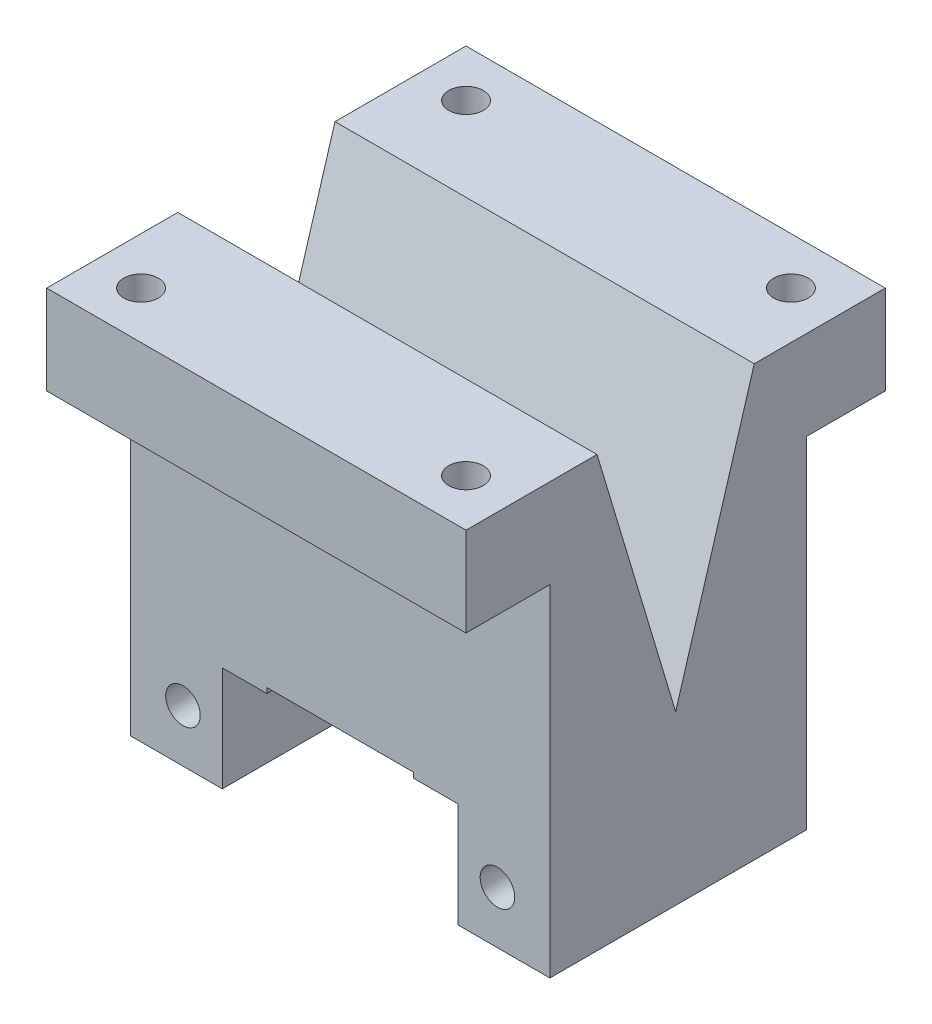
ISO-10303-21;
HEADER;
FILE_DESCRIPTION(('STEP AP214'),'2;1');
FILE_NAME('part.step','',(''),(''),'','','');
FILE_SCHEMA(('AUTOMOTIVE_DESIGN { 1 0 10303 214 1 1 1 1 }'));
ENDSEC;
DATA;
#1=APPLICATION_CONTEXT('core data for automotive mechanical design processes');
#2=APPLICATION_PROTOCOL_DEFINITION('international standard','automotive_design',2000,#1);
#3=PRODUCT_CONTEXT('',#1,'mechanical');
#4=PRODUCT('Part','Part','',(#3));
#5=PRODUCT_RELATED_PRODUCT_CATEGORY('part','',(#4));
#6=PRODUCT_DEFINITION_FORMATION('','',#4);
#7=PRODUCT_DEFINITION_CONTEXT('part definition',#1,'design');
#8=PRODUCT_DEFINITION('design','',#6,#7);
#9=PRODUCT_DEFINITION_SHAPE('','',#8);
#10=(LENGTH_UNIT() NAMED_UNIT(*) SI_UNIT(.MILLI.,.METRE.));
#11=(NAMED_UNIT(*) PLANE_ANGLE_UNIT() SI_UNIT($,.RADIAN.));
#12=(NAMED_UNIT(*) SI_UNIT($,.STERADIAN.) SOLID_ANGLE_UNIT());
#13=UNCERTAINTY_MEASURE_WITH_UNIT(LENGTH_MEASURE(1.E-05),#10,'distance_accuracy_value','');
#14=(GEOMETRIC_REPRESENTATION_CONTEXT(3) GLOBAL_UNCERTAINTY_ASSIGNED_CONTEXT((#13)) GLOBAL_UNIT_ASSIGNED_CONTEXT((#10,
#11,#12)) REPRESENTATION_CONTEXT('',''));
#15=CARTESIAN_POINT('',(0.,0.,0.));
#16=DIRECTION('',(0.,0.,1.));
#17=DIRECTION('',(1.,0.,0.));
#18=AXIS2_PLACEMENT_3D('',#15,#16,#17);
#19=CARTESIAN_POINT('',(0.,0.,0.));
#20=DIRECTION('',(0.,-1.,0.));
#21=DIRECTION('',(0.,0.,-1.));
#22=AXIS2_PLACEMENT_3D('',#19,#20,#21);
#23=PLANE('',#22);
#24=CARTESIAN_POINT('',(15.5,0.,-15.5));
#25=DIRECTION('',(0.,1.,0.));
#26=DIRECTION('',(0.,0.,1.));
#27=AXIS2_PLACEMENT_3D('',#24,#25,#26);
#28=CIRCLE('',#27,1.64999999999999);
#29=CARTESIAN_POINT('',(15.5,0.,-13.85));
#30=VERTEX_POINT('',#29);
#31=EDGE_CURVE('E376',#30,#30,#28,.T.);
#32=ORIENTED_EDGE('',*,*,#31,.F.);
#33=EDGE_LOOP('',(#32));
#34=FACE_BOUND('',#33,.T.);
#35=CARTESIAN_POINT('',(-15.5,0.,-15.5));
#36=DIRECTION('',(0.,1.,0.));
#37=DIRECTION('',(0.,0.,1.));
#38=AXIS2_PLACEMENT_3D('',#35,#36,#37);
#39=CIRCLE('',#38,1.64999999999999);
#40=CARTESIAN_POINT('',(-15.5,0.,-13.85));
#41=VERTEX_POINT('',#40);
#42=EDGE_CURVE('E373',#41,#41,#39,.T.);
#43=ORIENTED_EDGE('',*,*,#42,.F.);
#44=EDGE_LOOP('',(#43));
#45=FACE_BOUND('',#44,.T.);
#46=DIRECTION('',(0.,0.,1.));
#47=VECTOR('',#46,1.);
#48=CARTESIAN_POINT('',(-20.,0.,-20.));
#49=LINE('',#48,#47);
#50=CARTESIAN_POINT('',(-20.,0.,-20.));
#51=VERTEX_POINT('',#50);
#52=CARTESIAN_POINT('',(-20.,0.,-7.5));
#53=VERTEX_POINT('',#52);
#54=EDGE_CURVE('E393',#51,#53,#49,.T.);
#55=ORIENTED_EDGE('',*,*,#54,.T.);
#56=DIRECTION('',(-1.,0.,0.));
#57=VECTOR('',#56,1.);
#58=CARTESIAN_POINT('',(20.,0.,-7.5));
#59=LINE('',#58,#57);
#60=CARTESIAN_POINT('',(20.,0.,-7.5));
#61=VERTEX_POINT('',#60);
#62=EDGE_CURVE('E280',#61,#53,#59,.T.);
#63=ORIENTED_EDGE('',*,*,#62,.F.);
#64=DIRECTION('',(0.,0.,-1.));
#65=VECTOR('',#64,1.);
#66=CARTESIAN_POINT('',(20.,0.,-20.));
#67=LINE('',#66,#65);
#68=CARTESIAN_POINT('',(20.,0.,-20.));
#69=VERTEX_POINT('',#68);
#70=EDGE_CURVE('E399',#61,#69,#67,.T.);
#71=ORIENTED_EDGE('',*,*,#70,.T.);
#72=DIRECTION('',(-1.,0.,0.));
#73=VECTOR('',#72,1.);
#74=CARTESIAN_POINT('',(20.,0.,-20.));
#75=LINE('',#74,#73);
#76=EDGE_CURVE('E390',#69,#51,#75,.T.);
#77=ORIENTED_EDGE('',*,*,#76,.T.);
#78=EDGE_LOOP('',(#55,#63,#71,#77));
#79=FACE_BOUND('',#78,.T.);
#80=ADVANCED_FACE('F35',(#34,#45,#79),#23,.F.);
#81=CARTESIAN_POINT('',(20.,-41.,-20.));
#82=DIRECTION('',(0.,0.,-1.));
#83=DIRECTION('',(-1.,0.,0.));
#84=AXIS2_PLACEMENT_3D('',#81,#82,#83);
#85=PLANE('',#84);
#86=DIRECTION('',(0.,1.,0.));
#87=VECTOR('',#86,1.);
#88=CARTESIAN_POINT('',(20.,-41.,-20.));
#89=LINE('',#88,#87);
#90=CARTESIAN_POINT('',(20.,-8.5,-20.));
#91=VERTEX_POINT('',#90);
#92=EDGE_CURVE('E407',#91,#69,#89,.T.);
#93=ORIENTED_EDGE('',*,*,#92,.F.);
#94=DIRECTION('',(1.,0.,0.));
#95=VECTOR('',#94,1.);
#96=CARTESIAN_POINT('',(-20.,-8.5,-20.));
#97=LINE('',#96,#95);
#98=CARTESIAN_POINT('',(-20.,-8.5,-20.));
#99=VERTEX_POINT('',#98);
#100=EDGE_CURVE('E332',#99,#91,#97,.T.);
#101=ORIENTED_EDGE('',*,*,#100,.F.);
#102=DIRECTION('',(0.,1.,0.));
#103=VECTOR('',#102,1.);
#104=CARTESIAN_POINT('',(-20.,-41.,-20.));
#105=LINE('',#104,#103);
#106=EDGE_CURVE('E405',#99,#51,#105,.T.);
#107=ORIENTED_EDGE('',*,*,#106,.T.);
#108=ORIENTED_EDGE('',*,*,#76,.F.);
#109=EDGE_LOOP('',(#93,#101,#107,#108));
#110=FACE_BOUND('',#109,.T.);
#111=ADVANCED_FACE('F492',(#110),#85,.T.);
#112=CARTESIAN_POINT('',(20.,-41.,20.));
#113=DIRECTION('',(0.,0.,1.));
#114=DIRECTION('',(1.,0.,0.));
#115=AXIS2_PLACEMENT_3D('',#112,#113,#114);
#116=PLANE('',#115);
#117=DIRECTION('',(0.,1.,0.));
#118=VECTOR('',#117,1.);
#119=CARTESIAN_POINT('',(-20.,-41.,20.));
#120=LINE('',#119,#118);
#121=CARTESIAN_POINT('',(-20.,-8.5,20.));
#122=VERTEX_POINT('',#121);
#123=CARTESIAN_POINT('',(-20.,0.,20.));
#124=VERTEX_POINT('',#123);
#125=EDGE_CURVE('E392',#122,#124,#120,.T.);
#126=ORIENTED_EDGE('',*,*,#125,.F.);
#127=DIRECTION('',(-1.,0.,0.));
#128=VECTOR('',#127,1.);
#129=CARTESIAN_POINT('',(-20.,-8.5,20.));
#130=LINE('',#129,#128);
#131=CARTESIAN_POINT('',(20.,-8.5,20.));
#132=VERTEX_POINT('',#131);
#133=EDGE_CURVE('E207',#132,#122,#130,.T.);
#134=ORIENTED_EDGE('',*,*,#133,.F.);
#135=DIRECTION('',(0.,1.,0.));
#136=VECTOR('',#135,1.);
#137=CARTESIAN_POINT('',(20.,-41.,20.));
#138=LINE('',#137,#136);
#139=CARTESIAN_POINT('',(20.,0.,20.));
#140=VERTEX_POINT('',#139);
#141=EDGE_CURVE('E204',#132,#140,#138,.T.);
#142=ORIENTED_EDGE('',*,*,#141,.T.);
#143=DIRECTION('',(1.,0.,0.));
#144=VECTOR('',#143,1.);
#145=CARTESIAN_POINT('',(20.,0.,20.));
#146=LINE('',#145,#144);
#147=EDGE_CURVE('E396',#124,#140,#146,.T.);
#148=ORIENTED_EDGE('',*,*,#147,.F.);
#149=EDGE_LOOP('',(#126,#134,#142,#148));
#150=FACE_BOUND('',#149,.T.);
#151=ADVANCED_FACE('F499',(#150),#116,.T.);
#152=CARTESIAN_POINT('',(-15.5,0.,15.5));
#153=DIRECTION('',(0.,1.,0.));
#154=DIRECTION('',(0.,0.,1.));
#155=AXIS2_PLACEMENT_3D('',#152,#153,#154);
#156=CYLINDRICAL_SURFACE('',#155,1.64999999999999);
#157=CARTESIAN_POINT('',(-15.5,0.,15.5));
#158=DIRECTION('',(0.,1.,0.));
#159=DIRECTION('',(0.,0.,1.));
#160=AXIS2_PLACEMENT_3D('',#157,#158,#159);
#161=CIRCLE('',#160,1.64999999999999);
#162=CARTESIAN_POINT('',(-15.5,0.,17.15));
#163=VERTEX_POINT('',#162);
#164=EDGE_CURVE('E382',#163,#163,#161,.T.);
#165=ORIENTED_EDGE('',*,*,#164,.T.);
#166=EDGE_LOOP('',(#165));
#167=FACE_BOUND('',#166,.T.);
#168=CARTESIAN_POINT('',(-15.5,-8.5,15.5));
#169=DIRECTION('',(0.,-1.,0.));
#170=DIRECTION('',(0.,0.,-1.));
#171=AXIS2_PLACEMENT_3D('',#168,#169,#170);
#172=CIRCLE('',#171,1.64999999999999);
#173=CARTESIAN_POINT('',(-15.5,-8.5,13.85));
#174=VERTEX_POINT('',#173);
#175=EDGE_CURVE('E358',#174,#174,#172,.F.);
#176=ORIENTED_EDGE('',*,*,#175,.F.);
#177=EDGE_LOOP('',(#176));
#178=FACE_BOUND('',#177,.T.);
#179=ADVANCED_FACE('F529',(#167,#178),#156,.F.);
#180=CARTESIAN_POINT('',(15.5,0.,15.5));
#181=DIRECTION('',(0.,1.,0.));
#182=DIRECTION('',(0.,0.,1.));
#183=AXIS2_PLACEMENT_3D('',#180,#181,#182);
#184=CYLINDRICAL_SURFACE('',#183,1.64999999999999);
#185=CARTESIAN_POINT('',(15.5,0.,15.5));
#186=DIRECTION('',(0.,1.,0.));
#187=DIRECTION('',(0.,0.,1.));
#188=AXIS2_PLACEMENT_3D('',#185,#186,#187);
#189=CIRCLE('',#188,1.64999999999999);
#190=CARTESIAN_POINT('',(15.5,0.,17.15));
#191=VERTEX_POINT('',#190);
#192=EDGE_CURVE('E379',#191,#191,#189,.T.);
#193=ORIENTED_EDGE('',*,*,#192,.T.);
#194=EDGE_LOOP('',(#193));
#195=FACE_BOUND('',#194,.T.);
#196=CARTESIAN_POINT('',(15.5,-8.5,15.5));
#197=DIRECTION('',(0.,-1.,0.));
#198=DIRECTION('',(0.,0.,-1.));
#199=AXIS2_PLACEMENT_3D('',#196,#197,#198);
#200=CIRCLE('',#199,1.64999999999999);
#201=CARTESIAN_POINT('',(15.5,-8.5,13.85));
#202=VERTEX_POINT('',#201);
#203=EDGE_CURVE('E357',#202,#202,#200,.F.);
#204=ORIENTED_EDGE('',*,*,#203,.F.);
#205=EDGE_LOOP('',(#204));
#206=FACE_BOUND('',#205,.T.);
#207=ADVANCED_FACE('F533',(#195,#206),#184,.F.);
#208=CARTESIAN_POINT('',(15.5,0.,-15.5));
#209=DIRECTION('',(0.,1.,0.));
#210=DIRECTION('',(0.,0.,1.));
#211=AXIS2_PLACEMENT_3D('',#208,#209,#210);
#212=CYLINDRICAL_SURFACE('',#211,1.64999999999999);
#213=ORIENTED_EDGE('',*,*,#31,.T.);
#214=EDGE_LOOP('',(#213));
#215=FACE_BOUND('',#214,.T.);
#216=CARTESIAN_POINT('',(15.5,-8.5,-15.5));
#217=DIRECTION('',(0.,-1.,0.));
#218=DIRECTION('',(0.,0.,-1.));
#219=AXIS2_PLACEMENT_3D('',#216,#217,#218);
#220=CIRCLE('',#219,1.64999999999999);
#221=CARTESIAN_POINT('',(15.5,-8.5,-17.15));
#222=VERTEX_POINT('',#221);
#223=EDGE_CURVE('E354',#222,#222,#220,.F.);
#224=ORIENTED_EDGE('',*,*,#223,.F.);
#225=EDGE_LOOP('',(#224));
#226=FACE_BOUND('',#225,.T.);
#227=ADVANCED_FACE('F549',(#215,#226),#212,.F.);
#228=CARTESIAN_POINT('',(-15.5,0.,-15.5));
#229=DIRECTION('',(0.,1.,0.));
#230=DIRECTION('',(0.,0.,1.));
#231=AXIS2_PLACEMENT_3D('',#228,#229,#230);
#232=CYLINDRICAL_SURFACE('',#231,1.64999999999999);
#233=ORIENTED_EDGE('',*,*,#42,.T.);
#234=EDGE_LOOP('',(#233));
#235=FACE_BOUND('',#234,.T.);
#236=CARTESIAN_POINT('',(-15.5,-8.5,-15.5));
#237=DIRECTION('',(0.,-1.,0.));
#238=DIRECTION('',(0.,0.,-1.));
#239=AXIS2_PLACEMENT_3D('',#236,#237,#238);
#240=CIRCLE('',#239,1.64999999999999);
#241=CARTESIAN_POINT('',(-15.5,-8.5,-17.15));
#242=VERTEX_POINT('',#241);
#243=EDGE_CURVE('E353',#242,#242,#240,.F.);
#244=ORIENTED_EDGE('',*,*,#243,.F.);
#245=EDGE_LOOP('',(#244));
#246=FACE_BOUND('',#245,.T.);
#247=ADVANCED_FACE('F553',(#235,#246),#232,.F.);
#248=CARTESIAN_POINT('',(0.,-39.5,0.));
#249=DIRECTION('',(0.,1.,0.));
#250=DIRECTION('',(-1.,0.,0.));
#251=AXIS2_PLACEMENT_3D('',#248,#249,#250);
#252=PLANE('',#251);
#253=DIRECTION('',(1.,0.,0.));
#254=VECTOR('',#253,1.);
#255=CARTESIAN_POINT('',(-11.25,-39.5,0.));
#256=LINE('',#255,#254);
#257=CARTESIAN_POINT('',(-11.25,-39.5,0.));
#258=VERTEX_POINT('',#257);
#259=CARTESIAN_POINT('',(-10.,-39.5,0.));
#260=VERTEX_POINT('',#259);
#261=EDGE_CURVE('E305',#258,#260,#256,.T.);
#262=ORIENTED_EDGE('',*,*,#261,.T.);
#263=CARTESIAN_POINT('',(0.,-39.5,0.));
#264=DIRECTION('',(0.,1.,0.));
#265=DIRECTION('',(-1.,0.,0.));
#266=AXIS2_PLACEMENT_3D('',#263,#264,#265);
#267=CIRCLE('',#266,10.);
#268=CARTESIAN_POINT('',(10.,-39.5,0.));
#269=VERTEX_POINT('',#268);
#270=EDGE_CURVE('E361',#260,#269,#267,.F.);
#271=ORIENTED_EDGE('',*,*,#270,.T.);
#272=CARTESIAN_POINT('',(11.25,-39.5,0.));
#273=VERTEX_POINT('',#272);
#274=EDGE_CURVE('E308',#269,#273,#256,.T.);
#275=ORIENTED_EDGE('',*,*,#274,.T.);
#276=CARTESIAN_POINT('',(0.,-39.5,0.));
#277=DIRECTION('',(0.,1.,0.));
#278=DIRECTION('',(-1.,0.,0.));
#279=AXIS2_PLACEMENT_3D('',#276,#277,#278);
#280=CIRCLE('',#279,11.25);
#281=EDGE_CURVE('E370',#273,#258,#280,.T.);
#282=ORIENTED_EDGE('',*,*,#281,.T.);
#283=EDGE_LOOP('',(#262,#271,#275,#282));
#284=FACE_BOUND('',#283,.T.);
#285=ADVANCED_FACE('F450',(#284),#252,.T.);
#286=CARTESIAN_POINT('',(0.,0.,0.));
#287=DIRECTION('',(0.,1.,0.));
#288=DIRECTION('',(-1.,0.,0.));
#289=AXIS2_PLACEMENT_3D('',#286,#287,#288);
#290=CYLINDRICAL_SURFACE('',#289,11.25);
#291=DIRECTION('',(0.,-1.,0.));
#292=VECTOR('',#291,1.);
#293=CARTESIAN_POINT('',(-11.25,-39.5,0.));
#294=LINE('',#293,#292);
#295=CARTESIAN_POINT('',(-11.25,-32.5,0.));
#296=VERTEX_POINT('',#295);
#297=EDGE_CURVE('E321',#296,#258,#294,.T.);
#298=ORIENTED_EDGE('',*,*,#297,.T.);
#299=ORIENTED_EDGE('',*,*,#281,.F.);
#300=DIRECTION('',(0.,1.,0.));
#301=VECTOR('',#300,1.);
#302=CARTESIAN_POINT('',(11.25,-32.5,0.));
#303=LINE('',#302,#301);
#304=CARTESIAN_POINT('',(11.25,-32.5,0.));
#305=VERTEX_POINT('',#304);
#306=EDGE_CURVE('E208',#273,#305,#303,.T.);
#307=ORIENTED_EDGE('',*,*,#306,.T.);
#308=CARTESIAN_POINT('',(0.,-32.5,0.));
#309=DIRECTION('',(0.,1.,0.));
#310=DIRECTION('',(-1.,0.,0.));
#311=AXIS2_PLACEMENT_3D('',#308,#309,#310);
#312=CIRCLE('',#311,11.25);
#313=EDGE_CURVE('E367',#305,#296,#312,.T.);
#314=ORIENTED_EDGE('',*,*,#313,.T.);
#315=EDGE_LOOP('',(#298,#299,#307,#314));
#316=FACE_BOUND('',#315,.T.);
#317=ADVANCED_FACE('F447',(#316),#290,.F.);
#318=CARTESIAN_POINT('',(0.,-32.5,0.));
#319=DIRECTION('',(0.,-1.,0.));
#320=DIRECTION('',(1.,0.,0.));
#321=AXIS2_PLACEMENT_3D('',#318,#319,#320);
#322=PLANE('',#321);
#323=DIRECTION('',(1.,0.,0.));
#324=VECTOR('',#323,1.);
#325=CARTESIAN_POINT('',(0.,-32.5,0.));
#326=LINE('',#325,#324);
#327=CARTESIAN_POINT('',(-7.,-32.5,0.));
#328=VERTEX_POINT('',#327);
#329=EDGE_CURVE('E265',#296,#328,#326,.T.);
#330=ORIENTED_EDGE('',*,*,#329,.F.);
#331=ORIENTED_EDGE('',*,*,#313,.F.);
#332=CARTESIAN_POINT('',(7.,-32.5,0.));
#333=VERTEX_POINT('',#332);
#334=EDGE_CURVE('E262',#333,#305,#326,.T.);
#335=ORIENTED_EDGE('',*,*,#334,.F.);
#336=CARTESIAN_POINT('',(0.,-32.5,0.));
#337=DIRECTION('',(0.,-1.,0.));
#338=DIRECTION('',(1.,0.,0.));
#339=AXIS2_PLACEMENT_3D('',#336,#337,#338);
#340=CIRCLE('',#339,7.);
#341=EDGE_CURVE('E282',#328,#333,#340,.T.);
#342=ORIENTED_EDGE('',*,*,#341,.F.);
#343=EDGE_LOOP('',(#330,#331,#335,#342));
#344=FACE_BOUND('',#343,.T.);
#345=ADVANCED_FACE('F438',(#344),#322,.T.);
#346=CARTESIAN_POINT('',(0.,0.001000000000001,0.));
#347=DIRECTION('',(0.,-1.,0.));
#348=DIRECTION('',(0.,0.,-1.));
#349=AXIS2_PLACEMENT_3D('',#346,#347,#348);
#350=CYLINDRICAL_SURFACE('',#349,10.);
#351=ORIENTED_EDGE('',*,*,#270,.F.);
#352=DIRECTION('',(0.,-1.,0.));
#353=VECTOR('',#352,1.);
#354=CARTESIAN_POINT('',(-10.,0.001000000000001,0.));
#355=LINE('',#354,#353);
#356=CARTESIAN_POINT('',(-10.,-41.,0.));
#357=VERTEX_POINT('',#356);
#358=EDGE_CURVE('E318',#357,#260,#355,.F.);
#359=ORIENTED_EDGE('',*,*,#358,.F.);
#360=CARTESIAN_POINT('',(0.,-41.,0.));
#361=DIRECTION('',(0.,-1.,0.));
#362=DIRECTION('',(0.,0.,-1.));
#363=AXIS2_PLACEMENT_3D('',#360,#361,#362);
#364=CIRCLE('',#363,10.);
#365=CARTESIAN_POINT('',(10.,-41.,0.));
#366=VERTEX_POINT('',#365);
#367=EDGE_CURVE('E364',#357,#366,#364,.T.);
#368=ORIENTED_EDGE('',*,*,#367,.T.);
#369=DIRECTION('',(0.,-1.,0.));
#370=VECTOR('',#369,1.);
#371=CARTESIAN_POINT('',(10.,0.001000000000001,0.));
#372=LINE('',#371,#370);
#373=EDGE_CURVE('E316',#269,#366,#372,.T.);
#374=ORIENTED_EDGE('',*,*,#373,.F.);
#375=EDGE_LOOP('',(#351,#359,#368,#374));
#376=FACE_BOUND('',#375,.T.);
#377=ADVANCED_FACE('F459',(#376),#350,.F.);
#378=ORIENTED_EDGE('',*,*,#192,.F.);
#379=EDGE_LOOP('',(#378));
#380=FACE_BOUND('',#379,.T.);
#381=ORIENTED_EDGE('',*,*,#164,.F.);
#382=EDGE_LOOP('',(#381));
#383=FACE_BOUND('',#382,.T.);
#384=CARTESIAN_POINT('',(20.,0.,7.5));
#385=VERTEX_POINT('',#384);
#386=EDGE_CURVE('E400',#140,#385,#67,.T.);
#387=ORIENTED_EDGE('',*,*,#386,.T.);
#388=DIRECTION('',(-1.,0.,0.));
#389=VECTOR('',#388,1.);
#390=CARTESIAN_POINT('',(20.,0.,7.5));
#391=LINE('',#390,#389);
#392=CARTESIAN_POINT('',(-20.,0.,7.5));
#393=VERTEX_POINT('',#392);
#394=EDGE_CURVE('E283',#385,#393,#391,.T.);
#395=ORIENTED_EDGE('',*,*,#394,.T.);
#396=EDGE_CURVE('E385',#393,#124,#49,.T.);
#397=ORIENTED_EDGE('',*,*,#396,.T.);
#398=ORIENTED_EDGE('',*,*,#147,.T.);
#399=EDGE_LOOP('',(#387,#395,#397,#398));
#400=FACE_BOUND('',#399,.T.);
#401=ADVANCED_FACE('F495',(#380,#383,#400),#23,.F.);
#402=CARTESIAN_POINT('',(-20.,-41.,-20.));
#403=DIRECTION('',(-1.,0.,0.));
#404=DIRECTION('',(0.,0.,1.));
#405=AXIS2_PLACEMENT_3D('',#402,#403,#404);
#406=PLANE('',#405);
#407=DIRECTION('',(0.,-1.,0.));
#408=VECTOR('',#407,1.);
#409=CARTESIAN_POINT('',(-20.,-8.5,12.));
#410=LINE('',#409,#408);
#411=CARTESIAN_POINT('',(-20.,-8.5,12.));
#412=VERTEX_POINT('',#411);
#413=CARTESIAN_POINT('',(-20.,-41.,12.));
#414=VERTEX_POINT('',#413);
#415=EDGE_CURVE('E223',#412,#414,#410,.T.);
#416=ORIENTED_EDGE('',*,*,#415,.F.);
#417=DIRECTION('',(0.,0.,-1.));
#418=VECTOR('',#417,1.);
#419=CARTESIAN_POINT('',(-20.,-8.5,12.5));
#420=LINE('',#419,#418);
#421=EDGE_CURVE('E215',#122,#412,#420,.T.);
#422=ORIENTED_EDGE('',*,*,#421,.F.);
#423=ORIENTED_EDGE('',*,*,#125,.T.);
#424=ORIENTED_EDGE('',*,*,#396,.F.);
#425=DIRECTION('',(0.,0.957826285221151,0.287347885566345));
#426=VECTOR('',#425,1.);
#427=CARTESIAN_POINT('',(-20.,-25.,0.));
#428=LINE('',#427,#426);
#429=CARTESIAN_POINT('',(-20.,-25.,0.));
#430=VERTEX_POINT('',#429);
#431=EDGE_CURVE('E272',#430,#393,#428,.T.);
#432=ORIENTED_EDGE('',*,*,#431,.F.);
#433=DIRECTION('',(0.,-0.957826285221151,0.287347885566345));
#434=VECTOR('',#433,1.);
#435=CARTESIAN_POINT('',(-20.,0.,-7.5));
#436=LINE('',#435,#434);
#437=EDGE_CURVE('E276',#53,#430,#436,.T.);
#438=ORIENTED_EDGE('',*,*,#437,.F.);
#439=ORIENTED_EDGE('',*,*,#54,.F.);
#440=ORIENTED_EDGE('',*,*,#106,.F.);
#441=DIRECTION('',(0.,0.,-1.));
#442=VECTOR('',#441,1.);
#443=CARTESIAN_POINT('',(-20.,-8.5,-12.5));
#444=LINE('',#443,#442);
#445=CARTESIAN_POINT('',(-20.,-8.5,-12.5));
#446=VERTEX_POINT('',#445);
#447=EDGE_CURVE('E330',#446,#99,#444,.T.);
#448=ORIENTED_EDGE('',*,*,#447,.F.);
#449=DIRECTION('',(0.,-1.,0.));
#450=VECTOR('',#449,1.);
#451=CARTESIAN_POINT('',(-20.,-8.5,-12.5));
#452=LINE('',#451,#450);
#453=CARTESIAN_POINT('',(-20.,-41.,-12.5));
#454=VERTEX_POINT('',#453);
#455=EDGE_CURVE('E342',#446,#454,#452,.T.);
#456=ORIENTED_EDGE('',*,*,#455,.T.);
#457=DIRECTION('',(0.,0.,1.));
#458=VECTOR('',#457,1.);
#459=CARTESIAN_POINT('',(-20.,-41.,-20.));
#460=LINE('',#459,#458);
#461=EDGE_CURVE('E386',#454,#414,#460,.T.);
#462=ORIENTED_EDGE('',*,*,#461,.T.);
#463=EDGE_LOOP('',(#416,#422,#423,#424,#432,#438,#439,#440,#448,#456,#462));
#464=FACE_BOUND('',#463,.T.);
#465=ADVANCED_FACE('F37',(#464),#406,.T.);
#466=CARTESIAN_POINT('',(20.,-41.,-20.));
#467=DIRECTION('',(1.,0.,0.));
#468=DIRECTION('',(0.,0.,-1.));
#469=AXIS2_PLACEMENT_3D('',#466,#467,#468);
#470=PLANE('',#469);
#471=DIRECTION('',(0.,-1.,0.));
#472=VECTOR('',#471,1.);
#473=CARTESIAN_POINT('',(20.,-8.5,12.));
#474=LINE('',#473,#472);
#475=CARTESIAN_POINT('',(20.,-8.5,12.));
#476=VERTEX_POINT('',#475);
#477=CARTESIAN_POINT('',(20.,-41.,12.));
#478=VERTEX_POINT('',#477);
#479=EDGE_CURVE('E201',#476,#478,#474,.T.);
#480=ORIENTED_EDGE('',*,*,#479,.T.);
#481=DIRECTION('',(0.,0.,-1.));
#482=VECTOR('',#481,1.);
#483=CARTESIAN_POINT('',(20.,-41.,-20.));
#484=LINE('',#483,#482);
#485=CARTESIAN_POINT('',(20.,-41.,-12.5));
#486=VERTEX_POINT('',#485);
#487=EDGE_CURVE('E389',#478,#486,#484,.T.);
#488=ORIENTED_EDGE('',*,*,#487,.T.);
#489=DIRECTION('',(0.,-1.,0.));
#490=VECTOR('',#489,1.);
#491=CARTESIAN_POINT('',(20.,-8.5,-12.5));
#492=LINE('',#491,#490);
#493=CARTESIAN_POINT('',(20.,-8.5,-12.5));
#494=VERTEX_POINT('',#493);
#495=EDGE_CURVE('E340',#494,#486,#492,.T.);
#496=ORIENTED_EDGE('',*,*,#495,.F.);
#497=DIRECTION('',(0.,0.,1.));
#498=VECTOR('',#497,1.);
#499=CARTESIAN_POINT('',(20.,-8.5,-12.5));
#500=LINE('',#499,#498);
#501=EDGE_CURVE('E335',#91,#494,#500,.T.);
#502=ORIENTED_EDGE('',*,*,#501,.F.);
#503=ORIENTED_EDGE('',*,*,#92,.T.);
#504=ORIENTED_EDGE('',*,*,#70,.F.);
#505=DIRECTION('',(0.,-0.957826285221151,0.287347885566345));
#506=VECTOR('',#505,1.);
#507=CARTESIAN_POINT('',(20.,0.,-7.5));
#508=LINE('',#507,#506);
#509=CARTESIAN_POINT('',(20.,-25.,0.));
#510=VERTEX_POINT('',#509);
#511=EDGE_CURVE('E268',#61,#510,#508,.T.);
#512=ORIENTED_EDGE('',*,*,#511,.T.);
#513=DIRECTION('',(0.,0.957826285221151,0.287347885566345));
#514=VECTOR('',#513,1.);
#515=CARTESIAN_POINT('',(20.,-25.,0.));
#516=LINE('',#515,#514);
#517=EDGE_CURVE('E271',#510,#385,#516,.T.);
#518=ORIENTED_EDGE('',*,*,#517,.T.);
#519=ORIENTED_EDGE('',*,*,#386,.F.);
#520=ORIENTED_EDGE('',*,*,#141,.F.);
#521=DIRECTION('',(0.,0.,1.));
#522=VECTOR('',#521,1.);
#523=CARTESIAN_POINT('',(20.,-8.5,12.5));
#524=LINE('',#523,#522);
#525=EDGE_CURVE('E197',#476,#132,#524,.T.);
#526=ORIENTED_EDGE('',*,*,#525,.F.);
#527=EDGE_LOOP('',(#480,#488,#496,#502,#503,#504,#512,#518,#519,#520,#526));
#528=FACE_BOUND('',#527,.T.);
#529=ADVANCED_FACE('F199',(#528),#470,.T.);
#530=CARTESIAN_POINT('',(0.,-41.,0.));
#531=DIRECTION('',(0.,-1.,0.));
#532=DIRECTION('',(0.,0.,-1.));
#533=AXIS2_PLACEMENT_3D('',#530,#531,#532);
#534=PLANE('',#533);
#535=DIRECTION('',(-1.,0.,0.));
#536=VECTOR('',#535,1.);
#537=CARTESIAN_POINT('',(20.,-41.,12.));
#538=LINE('',#537,#536);
#539=CARTESIAN_POINT('',(-11.25,-41.,12.));
#540=VERTEX_POINT('',#539);
#541=EDGE_CURVE('E217',#540,#414,#538,.T.);
#542=ORIENTED_EDGE('',*,*,#541,.T.);
#543=ORIENTED_EDGE('',*,*,#461,.F.);
#544=DIRECTION('',(-1.,0.,0.));
#545=VECTOR('',#544,1.);
#546=CARTESIAN_POINT('',(-20.,-41.,-12.5));
#547=LINE('',#546,#545);
#548=EDGE_CURVE('E333',#486,#454,#547,.T.);
#549=ORIENTED_EDGE('',*,*,#548,.F.);
#550=ORIENTED_EDGE('',*,*,#487,.F.);
#551=CARTESIAN_POINT('',(11.25,-41.,12.));
#552=VERTEX_POINT('',#551);
#553=EDGE_CURVE('E222',#478,#552,#538,.T.);
#554=ORIENTED_EDGE('',*,*,#553,.T.);
#555=DIRECTION('',(0.,0.,1.));
#556=VECTOR('',#555,1.);
#557=CARTESIAN_POINT('',(11.25,-41.,0.));
#558=LINE('',#557,#556);
#559=CARTESIAN_POINT('',(11.25,-41.,0.));
#560=VERTEX_POINT('',#559);
#561=EDGE_CURVE('E310',#560,#552,#558,.T.);
#562=ORIENTED_EDGE('',*,*,#561,.F.);
#563=DIRECTION('',(1.,0.,0.));
#564=VECTOR('',#563,1.);
#565=CARTESIAN_POINT('',(-11.25,-41.,0.));
#566=LINE('',#565,#564);
#567=EDGE_CURVE('E313',#366,#560,#566,.T.);
#568=ORIENTED_EDGE('',*,*,#567,.F.);
#569=ORIENTED_EDGE('',*,*,#367,.F.);
#570=CARTESIAN_POINT('',(-11.25,-41.,0.));
#571=VERTEX_POINT('',#570);
#572=EDGE_CURVE('E301',#571,#357,#566,.T.);
#573=ORIENTED_EDGE('',*,*,#572,.F.);
#574=DIRECTION('',(0.,0.,-1.));
#575=VECTOR('',#574,1.);
#576=CARTESIAN_POINT('',(-11.25,-41.,0.));
#577=LINE('',#576,#575);
#578=EDGE_CURVE('E309',#540,#571,#577,.T.);
#579=ORIENTED_EDGE('',*,*,#578,.F.);
#580=EDGE_LOOP('',(#542,#543,#549,#550,#554,#562,#568,#569,#573,#579));
#581=FACE_BOUND('',#580,.T.);
#582=ADVANCED_FACE('F465',(#581),#534,.T.);
#583=CARTESIAN_POINT('',(0.,-8.5,0.));
#584=DIRECTION('',(0.,-1.,0.));
#585=DIRECTION('',(0.,0.,-1.));
#586=AXIS2_PLACEMENT_3D('',#583,#584,#585);
#587=PLANE('',#586);
#588=ORIENTED_EDGE('',*,*,#421,.T.);
#589=DIRECTION('',(-1.,0.,0.));
#590=VECTOR('',#589,1.);
#591=CARTESIAN_POINT('',(20.,-8.5,12.));
#592=LINE('',#591,#590);
#593=EDGE_CURVE('E211',#476,#412,#592,.T.);
#594=ORIENTED_EDGE('',*,*,#593,.F.);
#595=ORIENTED_EDGE('',*,*,#525,.T.);
#596=ORIENTED_EDGE('',*,*,#133,.T.);
#597=EDGE_LOOP('',(#588,#594,#595,#596));
#598=FACE_BOUND('',#597,.T.);
#599=ORIENTED_EDGE('',*,*,#203,.T.);
#600=EDGE_LOOP('',(#599));
#601=FACE_BOUND('',#600,.T.);
#602=ORIENTED_EDGE('',*,*,#175,.T.);
#603=EDGE_LOOP('',(#602));
#604=FACE_BOUND('',#603,.T.);
#605=ADVANCED_FACE('F212',(#598,#601,#604),#587,.T.);
#606=CARTESIAN_POINT('',(0.,-8.5,0.));
#607=DIRECTION('',(0.,-1.,0.));
#608=DIRECTION('',(0.,0.,-1.));
#609=AXIS2_PLACEMENT_3D('',#606,#607,#608);
#610=PLANE('',#609);
#611=ORIENTED_EDGE('',*,*,#447,.T.);
#612=ORIENTED_EDGE('',*,*,#100,.T.);
#613=ORIENTED_EDGE('',*,*,#501,.T.);
#614=DIRECTION('',(-1.,0.,0.));
#615=VECTOR('',#614,1.);
#616=CARTESIAN_POINT('',(-20.,-8.5,-12.5));
#617=LINE('',#616,#615);
#618=EDGE_CURVE('E337',#494,#446,#617,.T.);
#619=ORIENTED_EDGE('',*,*,#618,.T.);
#620=EDGE_LOOP('',(#611,#612,#613,#619));
#621=FACE_BOUND('',#620,.T.);
#622=ORIENTED_EDGE('',*,*,#243,.T.);
#623=EDGE_LOOP('',(#622));
#624=FACE_BOUND('',#623,.T.);
#625=ORIENTED_EDGE('',*,*,#223,.T.);
#626=EDGE_LOOP('',(#625));
#627=FACE_BOUND('',#626,.T.);
#628=ADVANCED_FACE('F544',(#621,#624,#627),#610,.T.);
#629=CARTESIAN_POINT('',(-20.,-8.5,-12.5));
#630=DIRECTION('',(0.,0.,1.));
#631=DIRECTION('',(1.,0.,0.));
#632=AXIS2_PLACEMENT_3D('',#629,#630,#631);
#633=PLANE('',#632);
#634=CARTESIAN_POINT('',(-15.,-36.,-12.5));
#635=DIRECTION('',(0.,0.,1.));
#636=DIRECTION('',(1.,0.,0.));
#637=AXIS2_PLACEMENT_3D('',#634,#635,#636);
#638=CIRCLE('',#637,1.65);
#639=CARTESIAN_POINT('',(-13.35,-36.,-12.5));
#640=VERTEX_POINT('',#639);
#641=EDGE_CURVE('E345',#640,#640,#638,.F.);
#642=ORIENTED_EDGE('',*,*,#641,.F.);
#643=EDGE_LOOP('',(#642));
#644=FACE_BOUND('',#643,.T.);
#645=ORIENTED_EDGE('',*,*,#548,.T.);
#646=ORIENTED_EDGE('',*,*,#455,.F.);
#647=ORIENTED_EDGE('',*,*,#618,.F.);
#648=ORIENTED_EDGE('',*,*,#495,.T.);
#649=EDGE_LOOP('',(#645,#646,#647,#648));
#650=FACE_BOUND('',#649,.T.);
#651=CARTESIAN_POINT('',(15.,-36.,-12.5));
#652=DIRECTION('',(0.,0.,1.));
#653=DIRECTION('',(1.,0.,0.));
#654=AXIS2_PLACEMENT_3D('',#651,#652,#653);
#655=CIRCLE('',#654,1.65);
#656=CARTESIAN_POINT('',(16.65,-36.,-12.5));
#657=VERTEX_POINT('',#656);
#658=EDGE_CURVE('E350',#657,#657,#655,.F.);
#659=ORIENTED_EDGE('',*,*,#658,.F.);
#660=EDGE_LOOP('',(#659));
#661=FACE_BOUND('',#660,.T.);
#662=ADVANCED_FACE('F568',(#644,#650,#661),#633,.F.);
#663=CARTESIAN_POINT('',(15.,-36.,-20.));
#664=DIRECTION('',(0.,0.,-1.));
#665=DIRECTION('',(-1.,0.,0.));
#666=AXIS2_PLACEMENT_3D('',#663,#664,#665);
#667=CYLINDRICAL_SURFACE('',#666,1.65);
#668=CARTESIAN_POINT('',(15.,-36.,12.));
#669=DIRECTION('',(0.,0.,-1.));
#670=DIRECTION('',(-1.,0.,0.));
#671=AXIS2_PLACEMENT_3D('',#668,#669,#670);
#672=CIRCLE('',#671,1.65);
#673=CARTESIAN_POINT('',(13.35,-36.,12.));
#674=VERTEX_POINT('',#673);
#675=EDGE_CURVE('E244',#674,#674,#672,.F.);
#676=ORIENTED_EDGE('',*,*,#675,.T.);
#677=EDGE_LOOP('',(#676));
#678=FACE_BOUND('',#677,.T.);
#679=ORIENTED_EDGE('',*,*,#658,.T.);
#680=EDGE_LOOP('',(#679));
#681=FACE_BOUND('',#680,.T.);
#682=ADVANCED_FACE('F564',(#678,#681),#667,.F.);
#683=CARTESIAN_POINT('',(-15.,-36.,-20.));
#684=DIRECTION('',(0.,0.,-1.));
#685=DIRECTION('',(-1.,0.,0.));
#686=AXIS2_PLACEMENT_3D('',#683,#684,#685);
#687=CYLINDRICAL_SURFACE('',#686,1.65);
#688=CARTESIAN_POINT('',(-15.,-36.,12.));
#689=DIRECTION('',(0.,0.,-1.));
#690=DIRECTION('',(-1.,0.,0.));
#691=AXIS2_PLACEMENT_3D('',#688,#689,#690);
#692=CIRCLE('',#691,1.65);
#693=CARTESIAN_POINT('',(-16.65,-36.,12.));
#694=VERTEX_POINT('',#693);
#695=EDGE_CURVE('E241',#694,#694,#692,.F.);
#696=ORIENTED_EDGE('',*,*,#695,.T.);
#697=EDGE_LOOP('',(#696));
#698=FACE_BOUND('',#697,.T.);
#699=ORIENTED_EDGE('',*,*,#641,.T.);
#700=EDGE_LOOP('',(#699));
#701=FACE_BOUND('',#700,.T.);
#702=ADVANCED_FACE('F567',(#698,#701),#687,.F.);
#703=CARTESIAN_POINT('',(-11.25,-39.5,20.));
#704=DIRECTION('',(1.,0.,0.));
#705=DIRECTION('',(0.,1.,0.));
#706=AXIS2_PLACEMENT_3D('',#703,#704,#705);
#707=PLANE('',#706);
#708=DIRECTION('',(0.,1.,0.));
#709=VECTOR('',#708,1.);
#710=CARTESIAN_POINT('',(-11.25,-39.5,12.));
#711=LINE('',#710,#709);
#712=CARTESIAN_POINT('',(-11.25,-31.,12.));
#713=VERTEX_POINT('',#712);
#714=EDGE_CURVE('E50',#540,#713,#711,.T.);
#715=ORIENTED_EDGE('',*,*,#714,.F.);
#716=ORIENTED_EDGE('',*,*,#578,.T.);
#717=DIRECTION('',(0.,-1.,0.));
#718=VECTOR('',#717,1.);
#719=CARTESIAN_POINT('',(-11.25,0.001000000000001,0.));
#720=LINE('',#719,#718);
#721=EDGE_CURVE('E319',#258,#571,#720,.T.);
#722=ORIENTED_EDGE('',*,*,#721,.F.);
#723=ORIENTED_EDGE('',*,*,#297,.F.);
#724=DIRECTION('',(0.,-1.,0.));
#725=VECTOR('',#724,1.);
#726=CARTESIAN_POINT('',(-11.25,-41.,0.));
#727=LINE('',#726,#725);
#728=CARTESIAN_POINT('',(-11.25,-31.,0.));
#729=VERTEX_POINT('',#728);
#730=EDGE_CURVE('E248',#729,#296,#727,.T.);
#731=ORIENTED_EDGE('',*,*,#730,.F.);
#732=DIRECTION('',(0.,0.,1.));
#733=VECTOR('',#732,1.);
#734=CARTESIAN_POINT('',(-11.25,-31.,-24.6221445044903));
#735=LINE('',#734,#733);
#736=EDGE_CURVE('E250',#729,#713,#735,.T.);
#737=ORIENTED_EDGE('',*,*,#736,.T.);
#738=EDGE_LOOP('',(#715,#716,#722,#723,#731,#737));
#739=FACE_BOUND('',#738,.T.);
#740=ADVANCED_FACE('F480',(#739),#707,.T.);
#741=CARTESIAN_POINT('',(11.25,-32.5,20.));
#742=DIRECTION('',(-1.,0.,0.));
#743=DIRECTION('',(0.,0.,1.));
#744=AXIS2_PLACEMENT_3D('',#741,#742,#743);
#745=PLANE('',#744);
#746=DIRECTION('',(0.,-1.,0.));
#747=VECTOR('',#746,1.);
#748=CARTESIAN_POINT('',(11.25,-32.5,12.));
#749=LINE('',#748,#747);
#750=CARTESIAN_POINT('',(11.25,-31.,12.));
#751=VERTEX_POINT('',#750);
#752=EDGE_CURVE('E239',#751,#552,#749,.T.);
#753=ORIENTED_EDGE('',*,*,#752,.F.);
#754=DIRECTION('',(0.,0.,1.));
#755=VECTOR('',#754,1.);
#756=CARTESIAN_POINT('',(11.25,-31.,-24.6221445044903));
#757=LINE('',#756,#755);
#758=CARTESIAN_POINT('',(11.25,-31.,0.));
#759=VERTEX_POINT('',#758);
#760=EDGE_CURVE('E256',#759,#751,#757,.T.);
#761=ORIENTED_EDGE('',*,*,#760,.F.);
#762=DIRECTION('',(0.,1.,0.));
#763=VECTOR('',#762,1.);
#764=CARTESIAN_POINT('',(11.25,-41.,0.));
#765=LINE('',#764,#763);
#766=EDGE_CURVE('E247',#305,#759,#765,.T.);
#767=ORIENTED_EDGE('',*,*,#766,.F.);
#768=ORIENTED_EDGE('',*,*,#306,.F.);
#769=DIRECTION('',(0.,-1.,0.));
#770=VECTOR('',#769,1.);
#771=CARTESIAN_POINT('',(11.25,0.001000000000001,0.));
#772=LINE('',#771,#770);
#773=EDGE_CURVE('E322',#273,#560,#772,.T.);
#774=ORIENTED_EDGE('',*,*,#773,.T.);
#775=ORIENTED_EDGE('',*,*,#561,.T.);
#776=EDGE_LOOP('',(#753,#761,#767,#768,#774,#775));
#777=FACE_BOUND('',#776,.T.);
#778=ADVANCED_FACE('F444',(#777),#745,.T.);
#779=CARTESIAN_POINT('',(-11.25,0.001000000000001,0.));
#780=DIRECTION('',(0.,0.,-1.));
#781=DIRECTION('',(-1.,0.,0.));
#782=AXIS2_PLACEMENT_3D('',#779,#780,#781);
#783=PLANE('',#782);
#784=ORIENTED_EDGE('',*,*,#373,.T.);
#785=ORIENTED_EDGE('',*,*,#567,.T.);
#786=ORIENTED_EDGE('',*,*,#773,.F.);
#787=ORIENTED_EDGE('',*,*,#274,.F.);
#788=EDGE_LOOP('',(#784,#785,#786,#787));
#789=FACE_BOUND('',#788,.T.);
#790=ADVANCED_FACE('F455',(#789),#783,.F.);
#791=ORIENTED_EDGE('',*,*,#721,.T.);
#792=ORIENTED_EDGE('',*,*,#572,.T.);
#793=ORIENTED_EDGE('',*,*,#358,.T.);
#794=ORIENTED_EDGE('',*,*,#261,.F.);
#795=EDGE_LOOP('',(#791,#792,#793,#794));
#796=FACE_BOUND('',#795,.T.);
#797=ADVANCED_FACE('F482',(#796),#783,.F.);
#798=CARTESIAN_POINT('',(0.,-30.5,0.));
#799=DIRECTION('',(0.,-1.,0.));
#800=DIRECTION('',(1.,0.,0.));
#801=AXIS2_PLACEMENT_3D('',#798,#799,#800);
#802=CYLINDRICAL_SURFACE('',#801,7.);
#803=ORIENTED_EDGE('',*,*,#341,.T.);
#804=DIRECTION('',(0.,-1.,0.));
#805=VECTOR('',#804,1.);
#806=CARTESIAN_POINT('',(7.,-30.5,0.));
#807=LINE('',#806,#805);
#808=CARTESIAN_POINT('',(7.,-31.,0.));
#809=VERTEX_POINT('',#808);
#810=EDGE_CURVE('E295',#809,#333,#807,.T.);
#811=ORIENTED_EDGE('',*,*,#810,.F.);
#812=CARTESIAN_POINT('',(7.,-30.5,0.));
#813=VERTEX_POINT('',#812);
#814=EDGE_CURVE('E302',#813,#809,#807,.T.);
#815=ORIENTED_EDGE('',*,*,#814,.F.);
#816=CARTESIAN_POINT('',(0.,-30.5,0.));
#817=DIRECTION('',(0.,-1.,0.));
#818=DIRECTION('',(1.,0.,0.));
#819=AXIS2_PLACEMENT_3D('',#816,#817,#818);
#820=CIRCLE('',#819,7.);
#821=CARTESIAN_POINT('',(-7.,-30.5,0.));
#822=VERTEX_POINT('',#821);
#823=EDGE_CURVE('E287',#822,#813,#820,.T.);
#824=ORIENTED_EDGE('',*,*,#823,.F.);
#825=DIRECTION('',(0.,-1.,0.));
#826=VECTOR('',#825,1.);
#827=CARTESIAN_POINT('',(-7.,-30.5,0.));
#828=LINE('',#827,#826);
#829=CARTESIAN_POINT('',(-7.,-31.,0.));
#830=VERTEX_POINT('',#829);
#831=EDGE_CURVE('E298',#822,#830,#828,.T.);
#832=ORIENTED_EDGE('',*,*,#831,.T.);
#833=DIRECTION('',(0.,-1.,0.));
#834=VECTOR('',#833,1.);
#835=CARTESIAN_POINT('',(-7.,-30.5,0.));
#836=LINE('',#835,#834);
#837=EDGE_CURVE('E264',#830,#328,#836,.T.);
#838=ORIENTED_EDGE('',*,*,#837,.T.);
#839=EDGE_LOOP('',(#803,#811,#815,#824,#832,#838));
#840=FACE_BOUND('',#839,.T.);
#841=ADVANCED_FACE('F432',(#840),#802,.F.);
#842=CARTESIAN_POINT('',(-7.,-30.5,0.));
#843=DIRECTION('',(-1.,0.,0.));
#844=DIRECTION('',(0.,-1.,0.));
#845=AXIS2_PLACEMENT_3D('',#842,#843,#844);
#846=PLANE('',#845);
#847=DIRECTION('',(0.,0.,-1.));
#848=VECTOR('',#847,1.);
#849=CARTESIAN_POINT('',(-7.,-30.5,0.));
#850=LINE('',#849,#848);
#851=CARTESIAN_POINT('',(-7.,-30.5,12.));
#852=VERTEX_POINT('',#851);
#853=EDGE_CURVE('E293',#852,#822,#850,.T.);
#854=ORIENTED_EDGE('',*,*,#853,.F.);
#855=DIRECTION('',(0.,-1.,0.));
#856=VECTOR('',#855,1.);
#857=CARTESIAN_POINT('',(-7.,-30.5,12.));
#858=LINE('',#857,#856);
#859=CARTESIAN_POINT('',(-7.,-31.,12.));
#860=VERTEX_POINT('',#859);
#861=EDGE_CURVE('E227',#852,#860,#858,.T.);
#862=ORIENTED_EDGE('',*,*,#861,.T.);
#863=DIRECTION('',(0.,0.,-1.));
#864=VECTOR('',#863,1.);
#865=CARTESIAN_POINT('',(-7.,-31.,0.));
#866=LINE('',#865,#864);
#867=EDGE_CURVE('E57',#860,#830,#866,.T.);
#868=ORIENTED_EDGE('',*,*,#867,.T.);
#869=ORIENTED_EDGE('',*,*,#831,.F.);
#870=EDGE_LOOP('',(#854,#862,#868,#869));
#871=FACE_BOUND('',#870,.T.);
#872=ADVANCED_FACE('F472',(#871),#846,.F.);
#873=CARTESIAN_POINT('',(7.,-30.5,12.5));
#874=DIRECTION('',(1.,0.,0.));
#875=DIRECTION('',(0.,1.,0.));
#876=AXIS2_PLACEMENT_3D('',#873,#874,#875);
#877=PLANE('',#876);
#878=DIRECTION('',(0.,0.,1.));
#879=VECTOR('',#878,1.);
#880=CARTESIAN_POINT('',(7.,-31.,12.5));
#881=LINE('',#880,#879);
#882=CARTESIAN_POINT('',(7.,-31.,12.));
#883=VERTEX_POINT('',#882);
#884=EDGE_CURVE('E43',#809,#883,#881,.T.);
#885=ORIENTED_EDGE('',*,*,#884,.T.);
#886=DIRECTION('',(0.,1.,0.));
#887=VECTOR('',#886,1.);
#888=CARTESIAN_POINT('',(7.,-30.5,12.));
#889=LINE('',#888,#887);
#890=CARTESIAN_POINT('',(7.,-30.5,12.));
#891=VERTEX_POINT('',#890);
#892=EDGE_CURVE('E233',#883,#891,#889,.T.);
#893=ORIENTED_EDGE('',*,*,#892,.T.);
#894=DIRECTION('',(0.,0.,1.));
#895=VECTOR('',#894,1.);
#896=CARTESIAN_POINT('',(7.,-30.5,12.5));
#897=LINE('',#896,#895);
#898=EDGE_CURVE('E290',#813,#891,#897,.T.);
#899=ORIENTED_EDGE('',*,*,#898,.F.);
#900=ORIENTED_EDGE('',*,*,#814,.T.);
#901=EDGE_LOOP('',(#885,#893,#899,#900));
#902=FACE_BOUND('',#901,.T.);
#903=ADVANCED_FACE('F420',(#902),#877,.F.);
#904=CARTESIAN_POINT('',(0.,-30.5,0.));
#905=DIRECTION('',(0.,-1.,0.));
#906=DIRECTION('',(1.,0.,0.));
#907=AXIS2_PLACEMENT_3D('',#904,#905,#906);
#908=PLANE('',#907);
#909=DIRECTION('',(1.,0.,0.));
#910=VECTOR('',#909,1.);
#911=CARTESIAN_POINT('',(0.,-30.5,12.));
#912=LINE('',#911,#910);
#913=EDGE_CURVE('E231',#852,#891,#912,.T.);
#914=ORIENTED_EDGE('',*,*,#913,.F.);
#915=ORIENTED_EDGE('',*,*,#853,.T.);
#916=ORIENTED_EDGE('',*,*,#823,.T.);
#917=ORIENTED_EDGE('',*,*,#898,.T.);
#918=EDGE_LOOP('',(#914,#915,#916,#917));
#919=FACE_BOUND('',#918,.T.);
#920=ADVANCED_FACE('F471',(#919),#908,.T.);
#921=CARTESIAN_POINT('',(20.,0.,-7.5));
#922=DIRECTION('',(0.,-0.287347885566345,-0.957826285221151));
#923=DIRECTION('',(0.,0.957826285221151,-0.287347885566345));
#924=AXIS2_PLACEMENT_3D('',#921,#922,#923);
#925=PLANE('',#924);
#926=ORIENTED_EDGE('',*,*,#437,.T.);
#927=DIRECTION('',(-1.,0.,0.));
#928=VECTOR('',#927,1.);
#929=CARTESIAN_POINT('',(20.,-25.,0.));
#930=LINE('',#929,#928);
#931=EDGE_CURVE('E275',#510,#430,#930,.T.);
#932=ORIENTED_EDGE('',*,*,#931,.F.);
#933=ORIENTED_EDGE('',*,*,#511,.F.);
#934=ORIENTED_EDGE('',*,*,#62,.T.);
#935=EDGE_LOOP('',(#926,#932,#933,#934));
#936=FACE_BOUND('',#935,.T.);
#937=ADVANCED_FACE('F622',(#936),#925,.F.);
#938=CARTESIAN_POINT('',(20.,-25.,0.));
#939=DIRECTION('',(0.,-0.287347885566345,0.957826285221151));
#940=DIRECTION('',(0.,-0.957826285221151,-0.287347885566345));
#941=AXIS2_PLACEMENT_3D('',#938,#939,#940);
#942=PLANE('',#941);
#943=ORIENTED_EDGE('',*,*,#431,.T.);
#944=ORIENTED_EDGE('',*,*,#394,.F.);
#945=ORIENTED_EDGE('',*,*,#517,.F.);
#946=ORIENTED_EDGE('',*,*,#931,.T.);
#947=EDGE_LOOP('',(#943,#944,#945,#946));
#948=FACE_BOUND('',#947,.T.);
#949=ADVANCED_FACE('F522',(#948),#942,.F.);
#950=CARTESIAN_POINT('',(-11.25,-31.,-24.6221445044903));
#951=DIRECTION('',(0.,1.,0.));
#952=DIRECTION('',(0.,0.,1.));
#953=AXIS2_PLACEMENT_3D('',#950,#951,#952);
#954=PLANE('',#953);
#955=ORIENTED_EDGE('',*,*,#760,.T.);
#956=DIRECTION('',(-1.,0.,0.));
#957=VECTOR('',#956,1.);
#958=CARTESIAN_POINT('',(-11.25,-31.,12.));
#959=LINE('',#958,#957);
#960=EDGE_CURVE('E236',#751,#883,#959,.T.);
#961=ORIENTED_EDGE('',*,*,#960,.T.);
#962=ORIENTED_EDGE('',*,*,#884,.F.);
#963=DIRECTION('',(-1.,0.,0.));
#964=VECTOR('',#963,1.);
#965=CARTESIAN_POINT('',(-11.25,-31.,0.));
#966=LINE('',#965,#964);
#967=EDGE_CURVE('E251',#759,#809,#966,.T.);
#968=ORIENTED_EDGE('',*,*,#967,.F.);
#969=EDGE_LOOP('',(#955,#961,#962,#968));
#970=FACE_BOUND('',#969,.T.);
#971=ADVANCED_FACE('F424',(#970),#954,.F.);
#972=CARTESIAN_POINT('',(-11.25,0.001000000000001,0.));
#973=DIRECTION('',(0.,0.,-1.));
#974=DIRECTION('',(-1.,0.,0.));
#975=AXIS2_PLACEMENT_3D('',#972,#973,#974);
#976=PLANE('',#975);
#977=ORIENTED_EDGE('',*,*,#334,.T.);
#978=ORIENTED_EDGE('',*,*,#766,.T.);
#979=ORIENTED_EDGE('',*,*,#967,.T.);
#980=ORIENTED_EDGE('',*,*,#810,.T.);
#981=EDGE_LOOP('',(#977,#978,#979,#980));
#982=FACE_BOUND('',#981,.T.);
#983=ADVANCED_FACE('F428',(#982),#976,.F.);
#984=ORIENTED_EDGE('',*,*,#329,.T.);
#985=ORIENTED_EDGE('',*,*,#837,.F.);
#986=EDGE_CURVE('E254',#830,#729,#966,.T.);
#987=ORIENTED_EDGE('',*,*,#986,.T.);
#988=ORIENTED_EDGE('',*,*,#730,.T.);
#989=EDGE_LOOP('',(#984,#985,#987,#988));
#990=FACE_BOUND('',#989,.T.);
#991=ADVANCED_FACE('F478',(#990),#976,.F.);
#992=ORIENTED_EDGE('',*,*,#867,.F.);
#993=DIRECTION('',(-1.,0.,0.));
#994=VECTOR('',#993,1.);
#995=CARTESIAN_POINT('',(-11.25,-31.,12.));
#996=LINE('',#995,#994);
#997=EDGE_CURVE('E11',#860,#713,#996,.T.);
#998=ORIENTED_EDGE('',*,*,#997,.T.);
#999=ORIENTED_EDGE('',*,*,#736,.F.);
#1000=ORIENTED_EDGE('',*,*,#986,.F.);
#1001=EDGE_LOOP('',(#992,#998,#999,#1000));
#1002=FACE_BOUND('',#1001,.T.);
#1003=ADVANCED_FACE('F474',(#1002),#954,.F.);
#1004=CARTESIAN_POINT('',(20.,-8.5,12.));
#1005=DIRECTION('',(0.,0.,-1.));
#1006=DIRECTION('',(-1.,0.,0.));
#1007=AXIS2_PLACEMENT_3D('',#1004,#1005,#1006);
#1008=PLANE('',#1007);
#1009=ORIENTED_EDGE('',*,*,#695,.F.);
#1010=EDGE_LOOP('',(#1009));
#1011=FACE_BOUND('',#1010,.T.);
#1012=ORIENTED_EDGE('',*,*,#752,.T.);
#1013=ORIENTED_EDGE('',*,*,#553,.F.);
#1014=ORIENTED_EDGE('',*,*,#479,.F.);
#1015=ORIENTED_EDGE('',*,*,#593,.T.);
#1016=ORIENTED_EDGE('',*,*,#415,.T.);
#1017=ORIENTED_EDGE('',*,*,#541,.F.);
#1018=ORIENTED_EDGE('',*,*,#714,.T.);
#1019=ORIENTED_EDGE('',*,*,#997,.F.);
#1020=ORIENTED_EDGE('',*,*,#861,.F.);
#1021=ORIENTED_EDGE('',*,*,#913,.T.);
#1022=ORIENTED_EDGE('',*,*,#892,.F.);
#1023=ORIENTED_EDGE('',*,*,#960,.F.);
#1024=EDGE_LOOP('',(#1012,#1013,#1014,#1015,#1016,#1017,#1018,#1019,#1020,#1021,#1022,#1023));
#1025=FACE_BOUND('',#1024,.T.);
#1026=ORIENTED_EDGE('',*,*,#675,.F.);
#1027=EDGE_LOOP('',(#1026));
#1028=FACE_BOUND('',#1027,.T.);
#1029=ADVANCED_FACE('F219',(#1011,#1025,#1028),#1008,.F.);
#1030=CLOSED_SHELL('',(#80,#111,#151,#179,#207,#227,#247,#285,#317,#345,#377,#401,#465,#529,
#582,#605,#628,#662,#682,#702,#740,#778,#790,#797,#841,#872,#903,#920,#937,#949,#971,#983,#991,
#1003,#1029));
#1031=MANIFOLD_SOLID_BREP('B2',#1030);
#1032=ADVANCED_BREP_SHAPE_REPRESENTATION('',(#18,#1031),#14);
#1033=SHAPE_DEFINITION_REPRESENTATION(#9,#1032);
ENDSEC;
END-ISO-10303-21;
